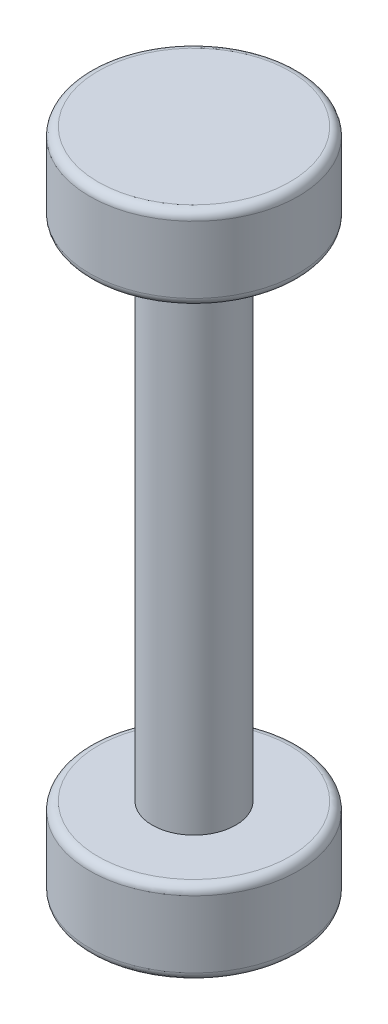
ISO-10303-21;
HEADER;
FILE_DESCRIPTION(('STEP AP214'),'2;1');
FILE_NAME('part.step','',(''),(''),'','','');
FILE_SCHEMA(('AUTOMOTIVE_DESIGN { 1 0 10303 214 1 1 1 1 }'));
ENDSEC;
DATA;
#1=APPLICATION_CONTEXT('core data for automotive mechanical design processes');
#2=APPLICATION_PROTOCOL_DEFINITION('international standard','automotive_design',2000,#1);
#3=PRODUCT_CONTEXT('',#1,'mechanical');
#4=PRODUCT('Part','Part','',(#3));
#5=PRODUCT_RELATED_PRODUCT_CATEGORY('part','',(#4));
#6=PRODUCT_DEFINITION_FORMATION('','',#4);
#7=PRODUCT_DEFINITION_CONTEXT('part definition',#1,'design');
#8=PRODUCT_DEFINITION('design','',#6,#7);
#9=PRODUCT_DEFINITION_SHAPE('','',#8);
#10=(LENGTH_UNIT() NAMED_UNIT(*) SI_UNIT(.MILLI.,.METRE.));
#11=(NAMED_UNIT(*) PLANE_ANGLE_UNIT() SI_UNIT($,.RADIAN.));
#12=(NAMED_UNIT(*) SI_UNIT($,.STERADIAN.) SOLID_ANGLE_UNIT());
#13=UNCERTAINTY_MEASURE_WITH_UNIT(LENGTH_MEASURE(1.E-05),#10,'distance_accuracy_value','');
#14=(GEOMETRIC_REPRESENTATION_CONTEXT(3) GLOBAL_UNCERTAINTY_ASSIGNED_CONTEXT((#13)) GLOBAL_UNIT_ASSIGNED_CONTEXT((#10,
#11,#12)) REPRESENTATION_CONTEXT('',''));
#15=CARTESIAN_POINT('',(0.,0.,0.));
#16=DIRECTION('',(0.,0.,1.));
#17=DIRECTION('',(1.,0.,0.));
#18=AXIS2_PLACEMENT_3D('',#15,#16,#17);
#19=CARTESIAN_POINT('',(0.,-2.,0.));
#20=DIRECTION('',(0.,1.,0.));
#21=DIRECTION('',(0.,0.,1.));
#22=AXIS2_PLACEMENT_3D('',#19,#20,#21);
#23=CYLINDRICAL_SURFACE('',#22,2.5);
#24=CARTESIAN_POINT('',(0.,-1.8,0.));
#25=DIRECTION('',(0.,1.,0.));
#26=DIRECTION('',(0.,0.,1.));
#27=AXIS2_PLACEMENT_3D('',#24,#25,#26);
#28=CIRCLE('',#27,2.5);
#29=CARTESIAN_POINT('',(0.,-1.8,2.5));
#30=VERTEX_POINT('',#29);
#31=EDGE_CURVE('E46',#30,#30,#28,.T.);
#32=ORIENTED_EDGE('',*,*,#31,.T.);
#33=EDGE_LOOP('',(#32));
#34=FACE_BOUND('',#33,.T.);
#35=CARTESIAN_POINT('',(0.,-0.2,0.));
#36=DIRECTION('',(0.,1.,0.));
#37=DIRECTION('',(0.,0.,1.));
#38=AXIS2_PLACEMENT_3D('',#35,#36,#37);
#39=CIRCLE('',#38,2.5);
#40=CARTESIAN_POINT('',(0.,-0.2,2.5));
#41=VERTEX_POINT('',#40);
#42=EDGE_CURVE('E51',#41,#41,#39,.F.);
#43=ORIENTED_EDGE('',*,*,#42,.T.);
#44=EDGE_LOOP('',(#43));
#45=FACE_BOUND('',#44,.T.);
#46=ADVANCED_FACE('F31',(#34,#45),#23,.T.);
#47=CARTESIAN_POINT('',(0.,-2.,0.));
#48=DIRECTION('',(0.,1.,0.));
#49=DIRECTION('',(0.,0.,1.));
#50=AXIS2_PLACEMENT_3D('',#47,#48,#49);
#51=PLANE('',#50);
#52=CARTESIAN_POINT('',(0.,-2.,0.));
#53=DIRECTION('',(0.,1.,0.));
#54=DIRECTION('',(0.,0.,1.));
#55=AXIS2_PLACEMENT_3D('',#52,#53,#54);
#56=CIRCLE('',#55,2.3);
#57=CARTESIAN_POINT('',(0.,-2.,2.3));
#58=VERTEX_POINT('',#57);
#59=EDGE_CURVE('E42',#58,#58,#56,.F.);
#60=ORIENTED_EDGE('',*,*,#59,.T.);
#61=EDGE_LOOP('',(#60));
#62=FACE_BOUND('',#61,.T.);
#63=CARTESIAN_POINT('',(0.,-2.,0.));
#64=DIRECTION('',(0.,1.,0.));
#65=DIRECTION('',(0.,0.,1.));
#66=AXIS2_PLACEMENT_3D('',#63,#64,#65);
#67=CIRCLE('',#66,1.);
#68=CARTESIAN_POINT('',(0.,-2.,1.));
#69=VERTEX_POINT('',#68);
#70=EDGE_CURVE('E63',#69,#69,#67,.F.);
#71=ORIENTED_EDGE('',*,*,#70,.F.);
#72=EDGE_LOOP('',(#71));
#73=FACE_BOUND('',#72,.T.);
#74=ADVANCED_FACE('F80',(#62,#73),#51,.F.);
#75=CARTESIAN_POINT('',(0.,0.,0.));
#76=DIRECTION('',(0.,1.,0.));
#77=DIRECTION('',(0.,0.,1.));
#78=AXIS2_PLACEMENT_3D('',#75,#76,#77);
#79=PLANE('',#78);
#80=CARTESIAN_POINT('',(0.,0.,0.));
#81=DIRECTION('',(0.,1.,0.));
#82=DIRECTION('',(0.,0.,1.));
#83=AXIS2_PLACEMENT_3D('',#80,#81,#82);
#84=CIRCLE('',#83,2.3);
#85=CARTESIAN_POINT('',(0.,0.,2.3));
#86=VERTEX_POINT('',#85);
#87=EDGE_CURVE('E10',#86,#86,#84,.T.);
#88=ORIENTED_EDGE('',*,*,#87,.T.);
#89=EDGE_LOOP('',(#88));
#90=FACE_BOUND('',#89,.T.);
#91=ADVANCED_FACE('F76',(#90),#79,.T.);
#92=CARTESIAN_POINT('',(0.,-14.,0.));
#93=DIRECTION('',(0.,1.,0.));
#94=DIRECTION('',(0.,0.,1.));
#95=AXIS2_PLACEMENT_3D('',#92,#93,#94);
#96=CYLINDRICAL_SURFACE('',#95,1.);
#97=CARTESIAN_POINT('',(0.,-14.,0.));
#98=DIRECTION('',(0.,-1.,0.));
#99=DIRECTION('',(0.,0.,-1.));
#100=AXIS2_PLACEMENT_3D('',#97,#98,#99);
#101=CIRCLE('',#100,1.);
#102=CARTESIAN_POINT('',(0.,-14.,-1.));
#103=VERTEX_POINT('',#102);
#104=EDGE_CURVE('E66',#103,#103,#101,.T.);
#105=ORIENTED_EDGE('',*,*,#104,.F.);
#106=EDGE_LOOP('',(#105));
#107=FACE_BOUND('',#106,.T.);
#108=ORIENTED_EDGE('',*,*,#70,.T.);
#109=EDGE_LOOP('',(#108));
#110=FACE_BOUND('',#109,.T.);
#111=ADVANCED_FACE('F72',(#107,#110),#96,.T.);
#112=CARTESIAN_POINT('',(0.,-16.,0.));
#113=DIRECTION('',(0.,1.,0.));
#114=DIRECTION('',(0.,0.,1.));
#115=AXIS2_PLACEMENT_3D('',#112,#113,#114);
#116=CYLINDRICAL_SURFACE('',#115,2.5);
#117=CARTESIAN_POINT('',(0.,-14.2,0.));
#118=DIRECTION('',(0.,-1.,0.));
#119=DIRECTION('',(0.,0.,-1.));
#120=AXIS2_PLACEMENT_3D('',#117,#118,#119);
#121=CIRCLE('',#120,2.5);
#122=CARTESIAN_POINT('',(0.,-14.2,-2.5));
#123=VERTEX_POINT('',#122);
#124=EDGE_CURVE('E57',#123,#123,#121,.T.);
#125=ORIENTED_EDGE('',*,*,#124,.T.);
#126=EDGE_LOOP('',(#125));
#127=FACE_BOUND('',#126,.T.);
#128=CARTESIAN_POINT('',(0.,-15.8,0.));
#129=DIRECTION('',(0.,-1.,0.));
#130=DIRECTION('',(0.,0.,-1.));
#131=AXIS2_PLACEMENT_3D('',#128,#129,#130);
#132=CIRCLE('',#131,2.5);
#133=CARTESIAN_POINT('',(0.,-15.8,-2.5));
#134=VERTEX_POINT('',#133);
#135=EDGE_CURVE('E60',#134,#134,#132,.F.);
#136=ORIENTED_EDGE('',*,*,#135,.T.);
#137=EDGE_LOOP('',(#136));
#138=FACE_BOUND('',#137,.T.);
#139=ADVANCED_FACE('F75',(#127,#138),#116,.T.);
#140=CARTESIAN_POINT('',(0.,-16.,0.));
#141=DIRECTION('',(0.,-1.,0.));
#142=DIRECTION('',(0.,0.,-1.));
#143=AXIS2_PLACEMENT_3D('',#140,#141,#142);
#144=PLANE('',#143);
#145=CARTESIAN_POINT('',(0.,-16.,0.));
#146=DIRECTION('',(0.,-1.,0.));
#147=DIRECTION('',(0.,0.,-1.));
#148=AXIS2_PLACEMENT_3D('',#145,#146,#147);
#149=CIRCLE('',#148,2.3);
#150=CARTESIAN_POINT('',(0.,-16.,-2.3));
#151=VERTEX_POINT('',#150);
#152=EDGE_CURVE('E38',#151,#151,#149,.T.);
#153=ORIENTED_EDGE('',*,*,#152,.T.);
#154=EDGE_LOOP('',(#153));
#155=FACE_BOUND('',#154,.T.);
#156=ADVANCED_FACE('F111',(#155),#144,.T.);
#157=CARTESIAN_POINT('',(0.,-14.,0.));
#158=DIRECTION('',(0.,-1.,0.));
#159=DIRECTION('',(0.,0.,-1.));
#160=AXIS2_PLACEMENT_3D('',#157,#158,#159);
#161=PLANE('',#160);
#162=CARTESIAN_POINT('',(0.,-14.,0.));
#163=DIRECTION('',(0.,-1.,0.));
#164=DIRECTION('',(0.,0.,-1.));
#165=AXIS2_PLACEMENT_3D('',#162,#163,#164);
#166=CIRCLE('',#165,2.3);
#167=CARTESIAN_POINT('',(0.,-14.,-2.3));
#168=VERTEX_POINT('',#167);
#169=EDGE_CURVE('E54',#168,#168,#166,.F.);
#170=ORIENTED_EDGE('',*,*,#169,.T.);
#171=EDGE_LOOP('',(#170));
#172=FACE_BOUND('',#171,.T.);
#173=ORIENTED_EDGE('',*,*,#104,.T.);
#174=EDGE_LOOP('',(#173));
#175=FACE_BOUND('',#174,.T.);
#176=ADVANCED_FACE('F70',(#172,#175),#161,.F.);
#177=CARTESIAN_POINT('',(0.,-14.2,0.));
#178=DIRECTION('',(0.,-1.,0.));
#179=DIRECTION('',(0.,0.,-1.));
#180=AXIS2_PLACEMENT_3D('',#177,#178,#179);
#181=TOROIDAL_SURFACE('',#180,2.3,0.2);
#182=ORIENTED_EDGE('',*,*,#169,.F.);
#183=EDGE_LOOP('',(#182));
#184=FACE_BOUND('',#183,.T.);
#185=ORIENTED_EDGE('',*,*,#124,.F.);
#186=EDGE_LOOP('',(#185));
#187=FACE_BOUND('',#186,.T.);
#188=ADVANCED_FACE('F93',(#184,#187),#181,.T.);
#189=CARTESIAN_POINT('',(0.,-1.8,0.));
#190=DIRECTION('',(0.,1.,0.));
#191=DIRECTION('',(0.,0.,1.));
#192=AXIS2_PLACEMENT_3D('',#189,#190,#191);
#193=TOROIDAL_SURFACE('',#192,2.3,0.2);
#194=ORIENTED_EDGE('',*,*,#59,.F.);
#195=EDGE_LOOP('',(#194));
#196=FACE_BOUND('',#195,.T.);
#197=ORIENTED_EDGE('',*,*,#31,.F.);
#198=EDGE_LOOP('',(#197));
#199=FACE_BOUND('',#198,.T.);
#200=ADVANCED_FACE('F96',(#196,#199),#193,.T.);
#201=CARTESIAN_POINT('',(0.,-15.8,0.));
#202=DIRECTION('',(0.,-1.,0.));
#203=DIRECTION('',(0.,0.,-1.));
#204=AXIS2_PLACEMENT_3D('',#201,#202,#203);
#205=TOROIDAL_SURFACE('',#204,2.3,0.2);
#206=ORIENTED_EDGE('',*,*,#135,.F.);
#207=EDGE_LOOP('',(#206));
#208=FACE_BOUND('',#207,.T.);
#209=ORIENTED_EDGE('',*,*,#152,.F.);
#210=EDGE_LOOP('',(#209));
#211=FACE_BOUND('',#210,.T.);
#212=ADVANCED_FACE('F99',(#208,#211),#205,.T.);
#213=CARTESIAN_POINT('',(0.,-0.2,0.));
#214=DIRECTION('',(0.,1.,0.));
#215=DIRECTION('',(0.,0.,1.));
#216=AXIS2_PLACEMENT_3D('',#213,#214,#215);
#217=TOROIDAL_SURFACE('',#216,2.3,0.2);
#218=ORIENTED_EDGE('',*,*,#42,.F.);
#219=EDGE_LOOP('',(#218));
#220=FACE_BOUND('',#219,.T.);
#221=ORIENTED_EDGE('',*,*,#87,.F.);
#222=EDGE_LOOP('',(#221));
#223=FACE_BOUND('',#222,.T.);
#224=ADVANCED_FACE('F33',(#220,#223),#217,.T.);
#225=CLOSED_SHELL('',(#46,#74,#91,#111,#139,#156,#176,#188,#200,#212,#224));
#226=MANIFOLD_SOLID_BREP('B2',#225);
#227=ADVANCED_BREP_SHAPE_REPRESENTATION('',(#18,#226),#14);
#228=SHAPE_DEFINITION_REPRESENTATION(#9,#227);
ENDSEC;
END-ISO-10303-21;
